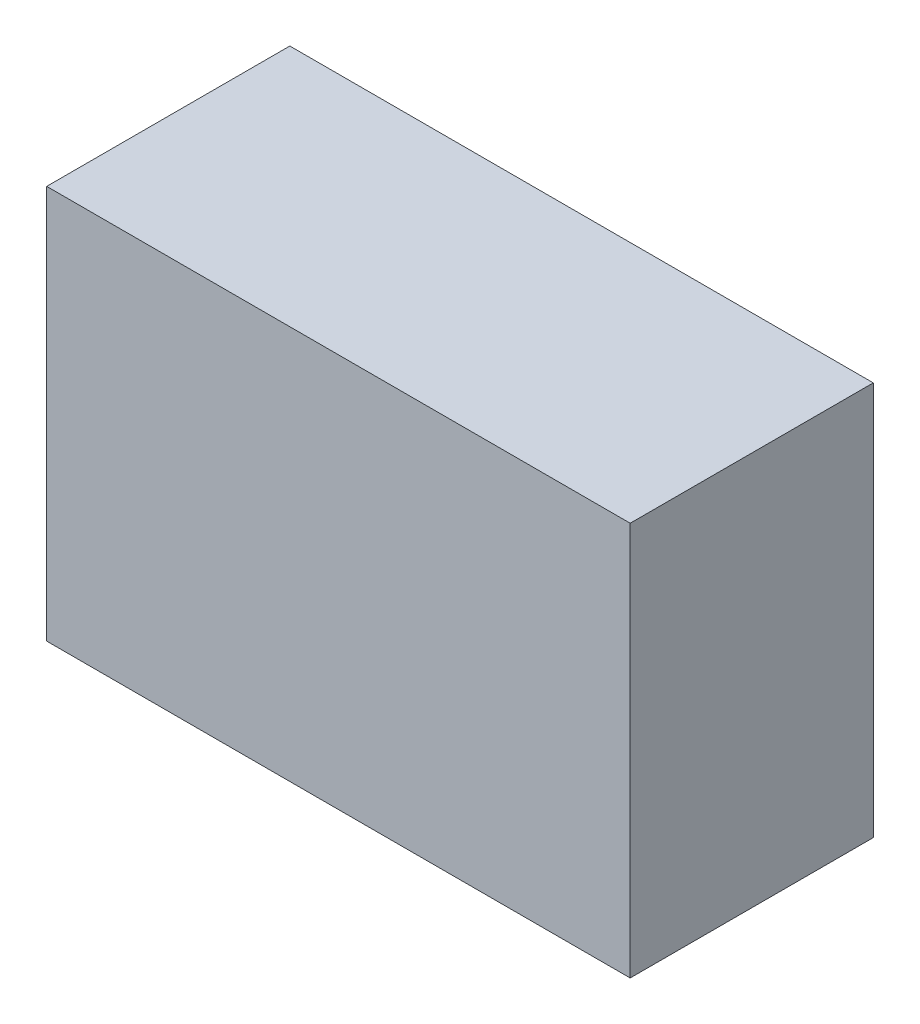
ISO-10303-21;
HEADER;
FILE_DESCRIPTION(('STEP AP214'),'2;1');
FILE_NAME('part.step','',(''),(''),'','','');
FILE_SCHEMA(('AUTOMOTIVE_DESIGN { 1 0 10303 214 1 1 1 1 }'));
ENDSEC;
DATA;
#1=APPLICATION_CONTEXT('core data for automotive mechanical design processes');
#2=APPLICATION_PROTOCOL_DEFINITION('international standard','automotive_design',2000,#1);
#3=PRODUCT_CONTEXT('',#1,'mechanical');
#4=PRODUCT('Part','Part','',(#3));
#5=PRODUCT_RELATED_PRODUCT_CATEGORY('part','',(#4));
#6=PRODUCT_DEFINITION_FORMATION('','',#4);
#7=PRODUCT_DEFINITION_CONTEXT('part definition',#1,'design');
#8=PRODUCT_DEFINITION('design','',#6,#7);
#9=PRODUCT_DEFINITION_SHAPE('','',#8);
#10=(LENGTH_UNIT() NAMED_UNIT(*) SI_UNIT(.MILLI.,.METRE.));
#11=(NAMED_UNIT(*) PLANE_ANGLE_UNIT() SI_UNIT($,.RADIAN.));
#12=(NAMED_UNIT(*) SI_UNIT($,.STERADIAN.) SOLID_ANGLE_UNIT());
#13=UNCERTAINTY_MEASURE_WITH_UNIT(LENGTH_MEASURE(1.E-05),#10,'distance_accuracy_value','');
#14=(GEOMETRIC_REPRESENTATION_CONTEXT(3) GLOBAL_UNCERTAINTY_ASSIGNED_CONTEXT((#13)) GLOBAL_UNIT_ASSIGNED_CONTEXT((#10,
#11,#12)) REPRESENTATION_CONTEXT('',''));
#15=CARTESIAN_POINT('',(0.,0.,0.));
#16=DIRECTION('',(0.,0.,1.));
#17=DIRECTION('',(1.,0.,0.));
#18=AXIS2_PLACEMENT_3D('',#15,#16,#17);
#19=CARTESIAN_POINT('',(-0.5999988,0.40500046,0.));
#20=DIRECTION('',(0.,0.,-1.));
#21=DIRECTION('',(-1.,0.,0.));
#22=AXIS2_PLACEMENT_3D('',#19,#20,#21);
#23=PLANE('',#22);
#24=DIRECTION('',(1.,0.,0.));
#25=VECTOR('',#24,1.);
#26=CARTESIAN_POINT('',(0.5999988,0.40500046,0.));
#27=LINE('',#26,#25);
#28=CARTESIAN_POINT('',(-0.5999988,0.40500046,0.));
#29=VERTEX_POINT('',#28);
#30=CARTESIAN_POINT('',(0.5999988,0.40500046,0.));
#31=VERTEX_POINT('',#30);
#32=EDGE_CURVE('E58',#29,#31,#27,.T.);
#33=ORIENTED_EDGE('',*,*,#32,.T.);
#34=DIRECTION('',(0.,1.,0.));
#35=VECTOR('',#34,1.);
#36=CARTESIAN_POINT('',(0.5999988,-0.40500046,0.));
#37=LINE('',#36,#35);
#38=CARTESIAN_POINT('',(0.5999988,-0.40500046,0.));
#39=VERTEX_POINT('',#38);
#40=EDGE_CURVE('E53',#31,#39,#37,.F.);
#41=ORIENTED_EDGE('',*,*,#40,.T.);
#42=DIRECTION('',(1.,0.,0.));
#43=VECTOR('',#42,1.);
#44=CARTESIAN_POINT('',(-0.5999988,-0.40500046,0.));
#45=LINE('',#44,#43);
#46=CARTESIAN_POINT('',(-0.5999988,-0.40500046,0.));
#47=VERTEX_POINT('',#46);
#48=EDGE_CURVE('E68',#39,#47,#45,.F.);
#49=ORIENTED_EDGE('',*,*,#48,.T.);
#50=DIRECTION('',(0.,1.,0.));
#51=VECTOR('',#50,1.);
#52=CARTESIAN_POINT('',(-0.5999988,0.40500046,0.));
#53=LINE('',#52,#51);
#54=EDGE_CURVE('E20',#47,#29,#53,.T.);
#55=ORIENTED_EDGE('',*,*,#54,.T.);
#56=EDGE_LOOP('',(#33,#41,#49,#55));
#57=FACE_BOUND('',#56,.T.);
#58=ADVANCED_FACE('F17',(#57),#23,.T.);
#59=CARTESIAN_POINT('',(-0.5999988,0.40500046,0.));
#60=DIRECTION('',(1.,0.,0.));
#61=DIRECTION('',(0.,0.,-1.));
#62=AXIS2_PLACEMENT_3D('',#59,#60,#61);
#63=PLANE('',#62);
#64=DIRECTION('',(0.,1.,0.));
#65=VECTOR('',#64,1.);
#66=CARTESIAN_POINT('',(-0.5999988,0.40500046,0.5));
#67=LINE('',#66,#65);
#68=CARTESIAN_POINT('',(-0.5999988,-0.40500046,0.5));
#69=VERTEX_POINT('',#68);
#70=CARTESIAN_POINT('',(-0.5999988,0.40500046,0.5));
#71=VERTEX_POINT('',#70);
#72=EDGE_CURVE('E74',#69,#71,#67,.T.);
#73=ORIENTED_EDGE('',*,*,#72,.T.);
#74=DIRECTION('',(0.,0.,-1.));
#75=VECTOR('',#74,1.);
#76=CARTESIAN_POINT('',(-0.5999988,0.40500046,0.));
#77=LINE('',#76,#75);
#78=EDGE_CURVE('E63',#71,#29,#77,.T.);
#79=ORIENTED_EDGE('',*,*,#78,.T.);
#80=ORIENTED_EDGE('',*,*,#54,.F.);
#81=DIRECTION('',(0.,0.,1.));
#82=VECTOR('',#81,1.);
#83=CARTESIAN_POINT('',(-0.5999988,-0.40500046,0.));
#84=LINE('',#83,#82);
#85=EDGE_CURVE('E80',#47,#69,#84,.T.);
#86=ORIENTED_EDGE('',*,*,#85,.T.);
#87=EDGE_LOOP('',(#73,#79,#80,#86));
#88=FACE_BOUND('',#87,.T.);
#89=ADVANCED_FACE('F73',(#88),#63,.F.);
#90=CARTESIAN_POINT('',(0.5999988,0.40500046,0.));
#91=DIRECTION('',(0.,-1.,0.));
#92=DIRECTION('',(0.,0.,-1.));
#93=AXIS2_PLACEMENT_3D('',#90,#91,#92);
#94=PLANE('',#93);
#95=DIRECTION('',(-1.,0.,0.));
#96=VECTOR('',#95,1.);
#97=CARTESIAN_POINT('',(-0.5999988,0.40500046,0.5));
#98=LINE('',#97,#96);
#99=CARTESIAN_POINT('',(0.5999988,0.40500046,0.5));
#100=VERTEX_POINT('',#99);
#101=EDGE_CURVE('E84',#71,#100,#98,.F.);
#102=ORIENTED_EDGE('',*,*,#101,.T.);
#103=DIRECTION('',(0.,0.,1.));
#104=VECTOR('',#103,1.);
#105=CARTESIAN_POINT('',(0.5999988,0.40500046,0.));
#106=LINE('',#105,#104);
#107=EDGE_CURVE('E65',#100,#31,#106,.F.);
#108=ORIENTED_EDGE('',*,*,#107,.T.);
#109=ORIENTED_EDGE('',*,*,#32,.F.);
#110=ORIENTED_EDGE('',*,*,#78,.F.);
#111=EDGE_LOOP('',(#102,#108,#109,#110));
#112=FACE_BOUND('',#111,.T.);
#113=ADVANCED_FACE('F61',(#112),#94,.F.);
#114=CARTESIAN_POINT('',(0.5999988,-0.40500046,0.));
#115=DIRECTION('',(-1.,0.,0.));
#116=DIRECTION('',(0.,0.,1.));
#117=AXIS2_PLACEMENT_3D('',#114,#115,#116);
#118=PLANE('',#117);
#119=DIRECTION('',(0.,1.,0.));
#120=VECTOR('',#119,1.);
#121=CARTESIAN_POINT('',(0.5999988,0.40500046,0.5));
#122=LINE('',#121,#120);
#123=CARTESIAN_POINT('',(0.5999988,-0.40500046,0.5));
#124=VERTEX_POINT('',#123);
#125=EDGE_CURVE('E26',#100,#124,#122,.F.);
#126=ORIENTED_EDGE('',*,*,#125,.T.);
#127=DIRECTION('',(0.,0.,1.));
#128=VECTOR('',#127,1.);
#129=CARTESIAN_POINT('',(0.5999988,-0.40500046,0.));
#130=LINE('',#129,#128);
#131=EDGE_CURVE('E34',#124,#39,#130,.F.);
#132=ORIENTED_EDGE('',*,*,#131,.T.);
#133=ORIENTED_EDGE('',*,*,#40,.F.);
#134=ORIENTED_EDGE('',*,*,#107,.F.);
#135=EDGE_LOOP('',(#126,#132,#133,#134));
#136=FACE_BOUND('',#135,.T.);
#137=ADVANCED_FACE('F88',(#136),#118,.F.);
#138=CARTESIAN_POINT('',(-0.5999988,-0.40500046,0.));
#139=DIRECTION('',(0.,1.,0.));
#140=DIRECTION('',(0.,0.,1.));
#141=AXIS2_PLACEMENT_3D('',#138,#139,#140);
#142=PLANE('',#141);
#143=DIRECTION('',(-1.,0.,0.));
#144=VECTOR('',#143,1.);
#145=CARTESIAN_POINT('',(-0.5999988,-0.40500046,0.5));
#146=LINE('',#145,#144);
#147=EDGE_CURVE('E11',#124,#69,#146,.T.);
#148=ORIENTED_EDGE('',*,*,#147,.T.);
#149=ORIENTED_EDGE('',*,*,#85,.F.);
#150=ORIENTED_EDGE('',*,*,#48,.F.);
#151=ORIENTED_EDGE('',*,*,#131,.F.);
#152=EDGE_LOOP('',(#148,#149,#150,#151));
#153=FACE_BOUND('',#152,.T.);
#154=ADVANCED_FACE('F91',(#153),#142,.F.);
#155=CARTESIAN_POINT('',(-0.5999988,0.40500046,0.5));
#156=DIRECTION('',(0.,0.,-1.));
#157=DIRECTION('',(-1.,0.,0.));
#158=AXIS2_PLACEMENT_3D('',#155,#156,#157);
#159=PLANE('',#158);
#160=ORIENTED_EDGE('',*,*,#125,.F.);
#161=ORIENTED_EDGE('',*,*,#101,.F.);
#162=ORIENTED_EDGE('',*,*,#72,.F.);
#163=ORIENTED_EDGE('',*,*,#147,.F.);
#164=EDGE_LOOP('',(#160,#161,#162,#163));
#165=FACE_BOUND('',#164,.T.);
#166=ADVANCED_FACE('F90',(#165),#159,.F.);
#167=CLOSED_SHELL('',(#58,#89,#113,#137,#154,#166));
#168=MANIFOLD_SOLID_BREP('B1',#167);
#169=ADVANCED_BREP_SHAPE_REPRESENTATION('',(#18,#168),#14);
#170=SHAPE_DEFINITION_REPRESENTATION(#9,#169);
ENDSEC;
END-ISO-10303-21;
